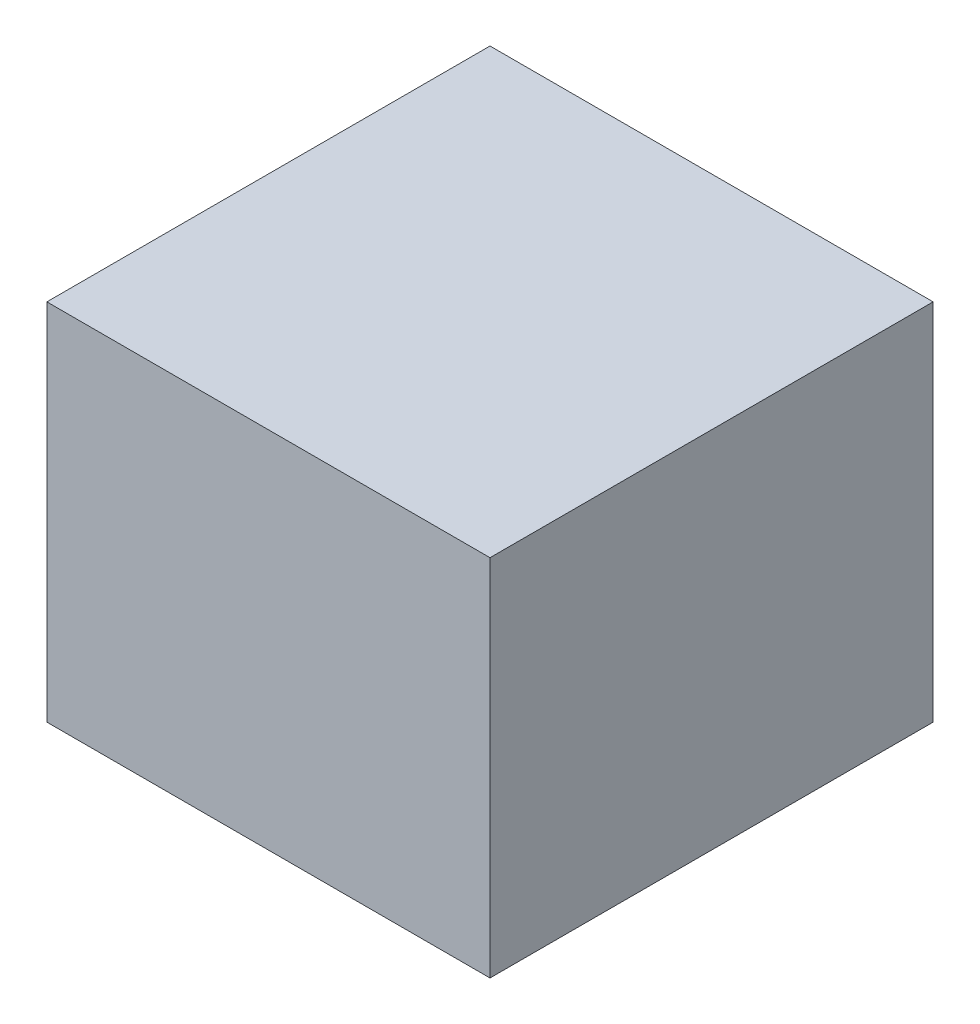
ISO-10303-21;
HEADER;
FILE_DESCRIPTION(('STEP AP214'),'2;1');
FILE_NAME('part.step','',(''),(''),'','','');
FILE_SCHEMA(('AUTOMOTIVE_DESIGN { 1 0 10303 214 1 1 1 1 }'));
ENDSEC;
DATA;
#1=APPLICATION_CONTEXT('core data for automotive mechanical design processes');
#2=APPLICATION_PROTOCOL_DEFINITION('international standard','automotive_design',2000,#1);
#3=PRODUCT_CONTEXT('',#1,'mechanical');
#4=PRODUCT('Part','Part','',(#3));
#5=PRODUCT_RELATED_PRODUCT_CATEGORY('part','',(#4));
#6=PRODUCT_DEFINITION_FORMATION('','',#4);
#7=PRODUCT_DEFINITION_CONTEXT('part definition',#1,'design');
#8=PRODUCT_DEFINITION('design','',#6,#7);
#9=PRODUCT_DEFINITION_SHAPE('','',#8);
#10=(LENGTH_UNIT() NAMED_UNIT(*) SI_UNIT(.MILLI.,.METRE.));
#11=(NAMED_UNIT(*) PLANE_ANGLE_UNIT() SI_UNIT($,.RADIAN.));
#12=(NAMED_UNIT(*) SI_UNIT($,.STERADIAN.) SOLID_ANGLE_UNIT());
#13=UNCERTAINTY_MEASURE_WITH_UNIT(LENGTH_MEASURE(1.E-05),#10,'distance_accuracy_value','');
#14=(GEOMETRIC_REPRESENTATION_CONTEXT(3) GLOBAL_UNCERTAINTY_ASSIGNED_CONTEXT((#13)) GLOBAL_UNIT_ASSIGNED_CONTEXT((#10,
#11,#12)) REPRESENTATION_CONTEXT('',''));
#15=CARTESIAN_POINT('',(0.,0.,0.));
#16=DIRECTION('',(0.,0.,1.));
#17=DIRECTION('',(1.,0.,0.));
#18=AXIS2_PLACEMENT_3D('',#15,#16,#17);
#19=CARTESIAN_POINT('',(70.,57.5,-70.));
#20=DIRECTION('',(-1.,0.,0.));
#21=DIRECTION('',(0.,0.,1.));
#22=AXIS2_PLACEMENT_3D('',#19,#20,#21);
#23=PLANE('',#22);
#24=DIRECTION('',(0.,0.,-1.));
#25=VECTOR('',#24,1.);
#26=CARTESIAN_POINT('',(70.,-57.5,-70.));
#27=LINE('',#26,#25);
#28=CARTESIAN_POINT('',(70.,-57.5,70.));
#29=VERTEX_POINT('',#28);
#30=CARTESIAN_POINT('',(70.,-57.5,-70.));
#31=VERTEX_POINT('',#30);
#32=EDGE_CURVE('E97',#29,#31,#27,.T.);
#33=ORIENTED_EDGE('',*,*,#32,.T.);
#34=DIRECTION('',(0.,-1.,0.));
#35=VECTOR('',#34,1.);
#36=CARTESIAN_POINT('',(70.,57.5,-70.));
#37=LINE('',#36,#35);
#38=CARTESIAN_POINT('',(70.,57.5,-70.));
#39=VERTEX_POINT('',#38);
#40=EDGE_CURVE('E11',#39,#31,#37,.T.);
#41=ORIENTED_EDGE('',*,*,#40,.F.);
#42=DIRECTION('',(0.,0.,-1.));
#43=VECTOR('',#42,1.);
#44=CARTESIAN_POINT('',(70.,57.5,-70.));
#45=LINE('',#44,#43);
#46=CARTESIAN_POINT('',(70.,57.5,70.));
#47=VERTEX_POINT('',#46);
#48=EDGE_CURVE('E85',#47,#39,#45,.T.);
#49=ORIENTED_EDGE('',*,*,#48,.F.);
#50=DIRECTION('',(0.,-1.,0.));
#51=VECTOR('',#50,1.);
#52=CARTESIAN_POINT('',(70.,57.5,70.));
#53=LINE('',#52,#51);
#54=EDGE_CURVE('E93',#47,#29,#53,.T.);
#55=ORIENTED_EDGE('',*,*,#54,.T.);
#56=EDGE_LOOP('',(#33,#41,#49,#55));
#57=FACE_BOUND('',#56,.T.);
#58=ADVANCED_FACE('F34',(#57),#23,.F.);
#59=CARTESIAN_POINT('',(-70.,57.5,-70.));
#60=DIRECTION('',(0.,0.,1.));
#61=DIRECTION('',(1.,0.,0.));
#62=AXIS2_PLACEMENT_3D('',#59,#60,#61);
#63=PLANE('',#62);
#64=DIRECTION('',(-1.,0.,0.));
#65=VECTOR('',#64,1.);
#66=CARTESIAN_POINT('',(-70.,-57.5,-70.));
#67=LINE('',#66,#65);
#68=CARTESIAN_POINT('',(-70.,-57.5,-70.));
#69=VERTEX_POINT('',#68);
#70=EDGE_CURVE('E89',#31,#69,#67,.T.);
#71=ORIENTED_EDGE('',*,*,#70,.T.);
#72=DIRECTION('',(0.,-1.,0.));
#73=VECTOR('',#72,1.);
#74=CARTESIAN_POINT('',(-70.,57.5,-70.));
#75=LINE('',#74,#73);
#76=CARTESIAN_POINT('',(-70.,57.5,-70.));
#77=VERTEX_POINT('',#76);
#78=EDGE_CURVE('E42',#77,#69,#75,.T.);
#79=ORIENTED_EDGE('',*,*,#78,.F.);
#80=DIRECTION('',(-1.,0.,0.));
#81=VECTOR('',#80,1.);
#82=CARTESIAN_POINT('',(-70.,57.5,-70.));
#83=LINE('',#82,#81);
#84=EDGE_CURVE('E80',#39,#77,#83,.T.);
#85=ORIENTED_EDGE('',*,*,#84,.F.);
#86=ORIENTED_EDGE('',*,*,#40,.T.);
#87=EDGE_LOOP('',(#71,#79,#85,#86));
#88=FACE_BOUND('',#87,.T.);
#89=ADVANCED_FACE('F88',(#88),#63,.F.);
#90=CARTESIAN_POINT('',(-70.,57.5,-70.));
#91=DIRECTION('',(1.,0.,0.));
#92=DIRECTION('',(0.,0.,-1.));
#93=AXIS2_PLACEMENT_3D('',#90,#91,#92);
#94=PLANE('',#93);
#95=DIRECTION('',(0.,0.,1.));
#96=VECTOR('',#95,1.);
#97=CARTESIAN_POINT('',(-70.,-57.5,-70.));
#98=LINE('',#97,#96);
#99=CARTESIAN_POINT('',(-70.,-57.5,70.));
#100=VERTEX_POINT('',#99);
#101=EDGE_CURVE('E67',#69,#100,#98,.T.);
#102=ORIENTED_EDGE('',*,*,#101,.T.);
#103=DIRECTION('',(0.,-1.,0.));
#104=VECTOR('',#103,1.);
#105=CARTESIAN_POINT('',(-70.,57.5,70.));
#106=LINE('',#105,#104);
#107=CARTESIAN_POINT('',(-70.,57.5,70.));
#108=VERTEX_POINT('',#107);
#109=EDGE_CURVE('E90',#108,#100,#106,.T.);
#110=ORIENTED_EDGE('',*,*,#109,.F.);
#111=DIRECTION('',(0.,0.,1.));
#112=VECTOR('',#111,1.);
#113=CARTESIAN_POINT('',(-70.,57.5,-70.));
#114=LINE('',#113,#112);
#115=EDGE_CURVE('E83',#77,#108,#114,.T.);
#116=ORIENTED_EDGE('',*,*,#115,.F.);
#117=ORIENTED_EDGE('',*,*,#78,.T.);
#118=EDGE_LOOP('',(#102,#110,#116,#117));
#119=FACE_BOUND('',#118,.T.);
#120=ADVANCED_FACE('F91',(#119),#94,.F.);
#121=CARTESIAN_POINT('',(-70.,57.5,70.));
#122=DIRECTION('',(0.,0.,-1.));
#123=DIRECTION('',(-1.,0.,0.));
#124=AXIS2_PLACEMENT_3D('',#121,#122,#123);
#125=PLANE('',#124);
#126=DIRECTION('',(1.,0.,0.));
#127=VECTOR('',#126,1.);
#128=CARTESIAN_POINT('',(-70.,-57.5,70.));
#129=LINE('',#128,#127);
#130=EDGE_CURVE('E73',#100,#29,#129,.T.);
#131=ORIENTED_EDGE('',*,*,#130,.T.);
#132=ORIENTED_EDGE('',*,*,#54,.F.);
#133=DIRECTION('',(1.,0.,0.));
#134=VECTOR('',#133,1.);
#135=CARTESIAN_POINT('',(-70.,57.5,70.));
#136=LINE('',#135,#134);
#137=EDGE_CURVE('E50',#108,#47,#136,.T.);
#138=ORIENTED_EDGE('',*,*,#137,.F.);
#139=ORIENTED_EDGE('',*,*,#109,.T.);
#140=EDGE_LOOP('',(#131,#132,#138,#139));
#141=FACE_BOUND('',#140,.T.);
#142=ADVANCED_FACE('F104',(#141),#125,.F.);
#143=CARTESIAN_POINT('',(0.,57.5,0.));
#144=DIRECTION('',(0.,1.,0.));
#145=DIRECTION('',(0.,0.,1.));
#146=AXIS2_PLACEMENT_3D('',#143,#144,#145);
#147=PLANE('',#146);
#148=ORIENTED_EDGE('',*,*,#48,.T.);
#149=ORIENTED_EDGE('',*,*,#84,.T.);
#150=ORIENTED_EDGE('',*,*,#115,.T.);
#151=ORIENTED_EDGE('',*,*,#137,.T.);
#152=EDGE_LOOP('',(#148,#149,#150,#151));
#153=FACE_BOUND('',#152,.T.);
#154=ADVANCED_FACE('F81',(#153),#147,.T.);
#155=CARTESIAN_POINT('',(0.,-57.5,0.));
#156=DIRECTION('',(0.,1.,0.));
#157=DIRECTION('',(0.,0.,1.));
#158=AXIS2_PLACEMENT_3D('',#155,#156,#157);
#159=PLANE('',#158);
#160=ORIENTED_EDGE('',*,*,#32,.F.);
#161=ORIENTED_EDGE('',*,*,#130,.F.);
#162=ORIENTED_EDGE('',*,*,#101,.F.);
#163=ORIENTED_EDGE('',*,*,#70,.F.);
#164=EDGE_LOOP('',(#160,#161,#162,#163));
#165=FACE_BOUND('',#164,.T.);
#166=ADVANCED_FACE('F107',(#165),#159,.F.);
#167=CLOSED_SHELL('',(#58,#89,#120,#142,#154,#166));
#168=MANIFOLD_SOLID_BREP('B2',#167);
#169=ADVANCED_BREP_SHAPE_REPRESENTATION('',(#18,#168),#14);
#170=SHAPE_DEFINITION_REPRESENTATION(#9,#169);
ENDSEC;
END-ISO-10303-21;
